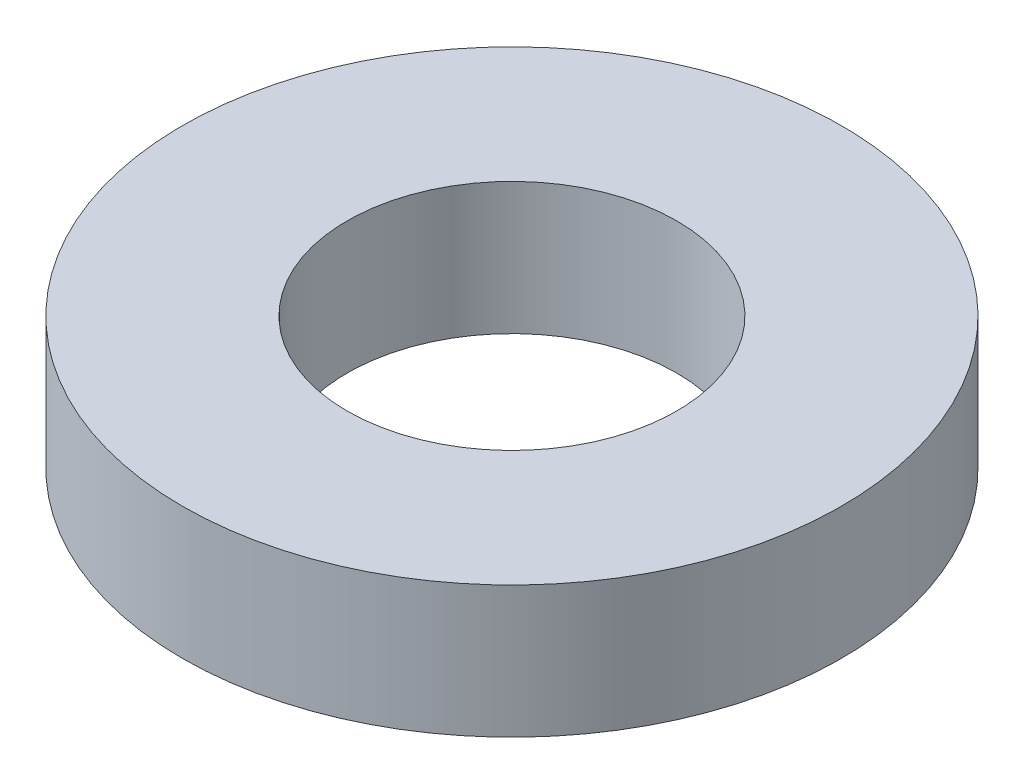
ISO-10303-21;
HEADER;
FILE_DESCRIPTION(('STEP AP214'),'2;1');
FILE_NAME('part.step','',(''),(''),'','','');
FILE_SCHEMA(('AUTOMOTIVE_DESIGN { 1 0 10303 214 1 1 1 1 }'));
ENDSEC;
DATA;
#1=APPLICATION_CONTEXT('core data for automotive mechanical design processes');
#2=APPLICATION_PROTOCOL_DEFINITION('international standard','automotive_design',2000,#1);
#3=PRODUCT_CONTEXT('',#1,'mechanical');
#4=PRODUCT('Part','Part','',(#3));
#5=PRODUCT_RELATED_PRODUCT_CATEGORY('part','',(#4));
#6=PRODUCT_DEFINITION_FORMATION('','',#4);
#7=PRODUCT_DEFINITION_CONTEXT('part definition',#1,'design');
#8=PRODUCT_DEFINITION('design','',#6,#7);
#9=PRODUCT_DEFINITION_SHAPE('','',#8);
#10=(LENGTH_UNIT() NAMED_UNIT(*) SI_UNIT(.MILLI.,.METRE.));
#11=(NAMED_UNIT(*) PLANE_ANGLE_UNIT() SI_UNIT($,.RADIAN.));
#12=(NAMED_UNIT(*) SI_UNIT($,.STERADIAN.) SOLID_ANGLE_UNIT());
#13=UNCERTAINTY_MEASURE_WITH_UNIT(LENGTH_MEASURE(1.E-05),#10,'distance_accuracy_value','');
#14=(GEOMETRIC_REPRESENTATION_CONTEXT(3) GLOBAL_UNCERTAINTY_ASSIGNED_CONTEXT((#13)) GLOBAL_UNIT_ASSIGNED_CONTEXT((#10,
#11,#12)) REPRESENTATION_CONTEXT('',''));
#15=CARTESIAN_POINT('',(0.,0.,0.));
#16=DIRECTION('',(0.,0.,1.));
#17=DIRECTION('',(1.,0.,0.));
#18=AXIS2_PLACEMENT_3D('',#15,#16,#17);
#19=CARTESIAN_POINT('',(0.,24.,0.));
#20=DIRECTION('',(0.,-1.,0.));
#21=DIRECTION('',(0.,0.,-1.));
#22=AXIS2_PLACEMENT_3D('',#19,#20,#21);
#23=CYLINDRICAL_SURFACE('',#22,60.);
#24=CARTESIAN_POINT('',(0.,24.,0.));
#25=DIRECTION('',(0.,1.,0.));
#26=DIRECTION('',(0.,0.,1.));
#27=AXIS2_PLACEMENT_3D('',#24,#25,#26);
#28=CIRCLE('',#27,60.);
#29=CARTESIAN_POINT('',(0.,24.,60.));
#30=VERTEX_POINT('',#29);
#31=EDGE_CURVE('E10',#30,#30,#28,.T.);
#32=ORIENTED_EDGE('',*,*,#31,.F.);
#33=EDGE_LOOP('',(#32));
#34=FACE_BOUND('',#33,.T.);
#35=CARTESIAN_POINT('',(0.,0.,0.));
#36=DIRECTION('',(0.,1.,0.));
#37=DIRECTION('',(0.,0.,1.));
#38=AXIS2_PLACEMENT_3D('',#35,#36,#37);
#39=CIRCLE('',#38,60.);
#40=CARTESIAN_POINT('',(0.,0.,60.));
#41=VERTEX_POINT('',#40);
#42=EDGE_CURVE('E37',#41,#41,#39,.T.);
#43=ORIENTED_EDGE('',*,*,#42,.T.);
#44=EDGE_LOOP('',(#43));
#45=FACE_BOUND('',#44,.T.);
#46=ADVANCED_FACE('F40',(#34,#45),#23,.T.);
#47=CARTESIAN_POINT('',(0.,24.,0.));
#48=DIRECTION('',(0.,1.,0.));
#49=DIRECTION('',(0.,0.,1.));
#50=AXIS2_PLACEMENT_3D('',#47,#48,#49);
#51=PLANE('',#50);
#52=CARTESIAN_POINT('',(0.,24.,0.));
#53=DIRECTION('',(0.,1.,0.));
#54=DIRECTION('',(0.,0.,1.));
#55=AXIS2_PLACEMENT_3D('',#52,#53,#54);
#56=CIRCLE('',#55,30.);
#57=CARTESIAN_POINT('',(0.,24.,30.));
#58=VERTEX_POINT('',#57);
#59=EDGE_CURVE('E50',#58,#58,#56,.T.);
#60=ORIENTED_EDGE('',*,*,#59,.F.);
#61=EDGE_LOOP('',(#60));
#62=FACE_BOUND('',#61,.T.);
#63=ORIENTED_EDGE('',*,*,#31,.T.);
#64=EDGE_LOOP('',(#63));
#65=FACE_BOUND('',#64,.T.);
#66=ADVANCED_FACE('F59',(#62,#65),#51,.T.);
#67=CARTESIAN_POINT('',(0.,0.,0.));
#68=DIRECTION('',(0.,1.,0.));
#69=DIRECTION('',(0.,0.,1.));
#70=AXIS2_PLACEMENT_3D('',#67,#68,#69);
#71=PLANE('',#70);
#72=CARTESIAN_POINT('',(0.,0.,0.));
#73=DIRECTION('',(0.,1.,0.));
#74=DIRECTION('',(0.,0.,1.));
#75=AXIS2_PLACEMENT_3D('',#72,#73,#74);
#76=CIRCLE('',#75,30.);
#77=CARTESIAN_POINT('',(0.,0.,30.));
#78=VERTEX_POINT('',#77);
#79=EDGE_CURVE('E47',#78,#78,#76,.T.);
#80=ORIENTED_EDGE('',*,*,#79,.T.);
#81=EDGE_LOOP('',(#80));
#82=FACE_BOUND('',#81,.T.);
#83=ORIENTED_EDGE('',*,*,#42,.F.);
#84=EDGE_LOOP('',(#83));
#85=FACE_BOUND('',#84,.T.);
#86=ADVANCED_FACE('F58',(#82,#85),#71,.F.);
#87=CARTESIAN_POINT('',(0.,24.,0.));
#88=DIRECTION('',(0.,-1.,0.));
#89=DIRECTION('',(0.,0.,-1.));
#90=AXIS2_PLACEMENT_3D('',#87,#88,#89);
#91=CYLINDRICAL_SURFACE('',#90,30.);
#92=ORIENTED_EDGE('',*,*,#59,.T.);
#93=EDGE_LOOP('',(#92));
#94=FACE_BOUND('',#93,.T.);
#95=ORIENTED_EDGE('',*,*,#79,.F.);
#96=EDGE_LOOP('',(#95));
#97=FACE_BOUND('',#96,.T.);
#98=ADVANCED_FACE('F54',(#94,#97),#91,.F.);
#99=CLOSED_SHELL('',(#46,#66,#86,#98));
#100=MANIFOLD_SOLID_BREP('B2',#99);
#101=ADVANCED_BREP_SHAPE_REPRESENTATION('',(#18,#100),#14);
#102=SHAPE_DEFINITION_REPRESENTATION(#9,#101);
ENDSEC;
END-ISO-10303-21;
